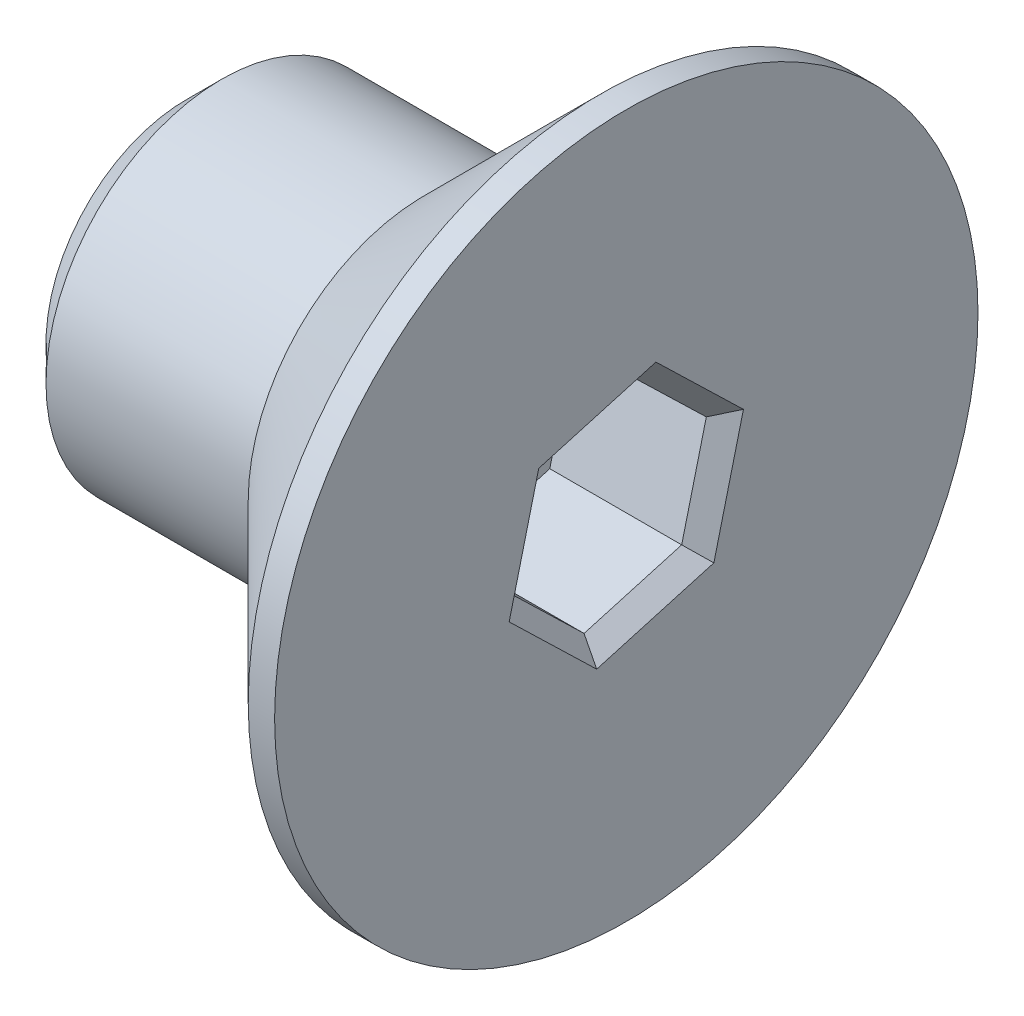
ISO-10303-21;
HEADER;
FILE_DESCRIPTION(('STEP AP214'),'2;1');
FILE_NAME('part.step','',(''),(''),'','','');
FILE_SCHEMA(('AUTOMOTIVE_DESIGN { 1 0 10303 214 1 1 1 1 }'));
ENDSEC;
DATA;
#1=APPLICATION_CONTEXT('core data for automotive mechanical design processes');
#2=APPLICATION_PROTOCOL_DEFINITION('international standard','automotive_design',2000,#1);
#3=PRODUCT_CONTEXT('',#1,'mechanical');
#4=PRODUCT('Part','Part','',(#3));
#5=PRODUCT_RELATED_PRODUCT_CATEGORY('part','',(#4));
#6=PRODUCT_DEFINITION_FORMATION('','',#4);
#7=PRODUCT_DEFINITION_CONTEXT('part definition',#1,'design');
#8=PRODUCT_DEFINITION('design','',#6,#7);
#9=PRODUCT_DEFINITION_SHAPE('','',#8);
#10=(LENGTH_UNIT() NAMED_UNIT(*) SI_UNIT(.MILLI.,.METRE.));
#11=(NAMED_UNIT(*) PLANE_ANGLE_UNIT() SI_UNIT($,.RADIAN.));
#12=(NAMED_UNIT(*) SI_UNIT($,.STERADIAN.) SOLID_ANGLE_UNIT());
#13=UNCERTAINTY_MEASURE_WITH_UNIT(LENGTH_MEASURE(1.E-05),#10,'distance_accuracy_value','');
#14=(GEOMETRIC_REPRESENTATION_CONTEXT(3) GLOBAL_UNCERTAINTY_ASSIGNED_CONTEXT((#13)) GLOBAL_UNIT_ASSIGNED_CONTEXT((#10,
#11,#12)) REPRESENTATION_CONTEXT('',''));
#15=CARTESIAN_POINT('',(0.,0.,0.));
#16=DIRECTION('',(0.,0.,1.));
#17=DIRECTION('',(1.,0.,0.));
#18=AXIS2_PLACEMENT_3D('',#15,#16,#17);
#19=CARTESIAN_POINT('',(4.68297067855263,13.4479055596939,0.388590849571879));
#20=DIRECTION('',(-1.,0.,0.));
#21=DIRECTION('',(0.,0.,1.));
#22=AXIS2_PLACEMENT_3D('',#19,#20,#21);
#23=PLANE('',#22);
#24=CARTESIAN_POINT('',(4.68297067851609,15.,0.));
#25=DIRECTION('',(1.,0.,0.));
#26=DIRECTION('',(0.,0.,-1.));
#27=AXIS2_PLACEMENT_3D('',#24,#25,#26);
#28=CIRCLE('',#27,1.6000000000905);
#29=CARTESIAN_POINT('',(4.68297067851609,15.,-1.6000000000905));
#30=VERTEX_POINT('',#29);
#31=EDGE_CURVE('E19',#30,#30,#28,.T.);
#32=ORIENTED_EDGE('',*,*,#31,.F.);
#33=EDGE_LOOP('',(#32));
#34=FACE_BOUND('',#33,.T.);
#35=ADVANCED_FACE('F16',(#34),#23,.T.);
#36=CARTESIAN_POINT('',(5.08297067847252,15.,0.));
#37=DIRECTION('',(1.,0.,0.));
#38=DIRECTION('',(0.,0.,-1.));
#39=AXIS2_PLACEMENT_3D('',#36,#37,#38);
#40=CONICAL_SURFACE('',#39,2.00000000002573,0.785398163370943);
#41=CARTESIAN_POINT('',(5.08297067855263,15.,0.));
#42=DIRECTION('',(-1.,0.,0.));
#43=DIRECTION('',(0.,0.,1.));
#44=AXIS2_PLACEMENT_3D('',#41,#42,#43);
#45=CIRCLE('',#44,2.);
#46=CARTESIAN_POINT('',(5.08297067855263,15.,2.));
#47=VERTEX_POINT('',#46);
#48=EDGE_CURVE('E117',#47,#47,#45,.F.);
#49=ORIENTED_EDGE('',*,*,#48,.F.);
#50=EDGE_LOOP('',(#49));
#51=FACE_BOUND('',#50,.T.);
#52=ORIENTED_EDGE('',*,*,#31,.T.);
#53=EDGE_LOOP('',(#52));
#54=FACE_BOUND('',#53,.T.);
#55=ADVANCED_FACE('F561',(#51,#54),#40,.T.);
#56=CARTESIAN_POINT('',(7.98297067854037,15.,0.));
#57=DIRECTION('',(1.,0.,0.));
#58=DIRECTION('',(0.,0.,-1.));
#59=AXIS2_PLACEMENT_3D('',#56,#57,#58);
#60=CONICAL_SURFACE('',#59,0.999999999990402,1.04719755118113);
#61=CARTESIAN_POINT('',(7.4056204093722,15.,0.));
#62=VERTEX_POINT('',#61);
#63=VERTEX_LOOP('',#62);
#64=FACE_BOUND('',#63,.T.);
#65=CARTESIAN_POINT('',(7.98297067854037,15.,0.));
#66=DIRECTION('',(1.,0.,0.));
#67=DIRECTION('',(0.,0.,-1.));
#68=AXIS2_PLACEMENT_3D('',#65,#66,#67);
#69=CIRCLE('',#68,0.999999999990402);
#70=CARTESIAN_POINT('',(7.9829706785465,14.0384696005274,-0.274698545464686));
#71=VERTEX_POINT('',#70);
#72=CARTESIAN_POINT('',(7.9829706785465,14.7571307190109,-0.970059025184754));
#73=VERTEX_POINT('',#72);
#74=EDGE_CURVE('E109',#71,#73,#69,.T.);
#75=ORIENTED_EDGE('',*,*,#74,.T.);
#76=CARTESIAN_POINT('',(7.98297067854037,15.,0.));
#77=DIRECTION('',(1.,0.,0.));
#78=DIRECTION('',(0.,0.,-1.));
#79=AXIS2_PLACEMENT_3D('',#76,#77,#78);
#80=CIRCLE('',#79,0.999999999990403);
#81=CARTESIAN_POINT('',(7.9829706785465,15.7186611184914,-0.695360479721949));
#82=VERTEX_POINT('',#81);
#83=EDGE_CURVE('E113',#73,#82,#80,.T.);
#84=ORIENTED_EDGE('',*,*,#83,.T.);
#85=CARTESIAN_POINT('',(7.98297067854037,15.,0.));
#86=DIRECTION('',(1.,0.,0.));
#87=DIRECTION('',(0.,0.,-1.));
#88=AXIS2_PLACEMENT_3D('',#85,#86,#87);
#89=CIRCLE('',#88,0.999999999990403);
#90=CARTESIAN_POINT('',(7.9829706785465,15.9615303994726,0.274698545464687));
#91=VERTEX_POINT('',#90);
#92=EDGE_CURVE('E134',#82,#91,#89,.T.);
#93=ORIENTED_EDGE('',*,*,#92,.T.);
#94=CARTESIAN_POINT('',(7.98297067854037,15.,0.));
#95=DIRECTION('',(1.,0.,0.));
#96=DIRECTION('',(0.,0.,-1.));
#97=AXIS2_PLACEMENT_3D('',#94,#95,#96);
#98=CIRCLE('',#97,0.999999999990402);
#99=CARTESIAN_POINT('',(7.9829706785465,15.2428692809813,0.970059025186637));
#100=VERTEX_POINT('',#99);
#101=EDGE_CURVE('E135',#91,#100,#98,.T.);
#102=ORIENTED_EDGE('',*,*,#101,.T.);
#103=CARTESIAN_POINT('',(7.98297067854037,15.,0.));
#104=DIRECTION('',(1.,0.,0.));
#105=DIRECTION('',(0.,0.,-1.));
#106=AXIS2_PLACEMENT_3D('',#103,#104,#105);
#107=CIRCLE('',#106,0.999999999990403);
#108=CARTESIAN_POINT('',(7.9829706785465,14.2813388815086,0.695360479721952));
#109=VERTEX_POINT('',#108);
#110=EDGE_CURVE('E206',#100,#109,#107,.T.);
#111=ORIENTED_EDGE('',*,*,#110,.T.);
#112=CARTESIAN_POINT('',(7.98297067854037,15.,0.));
#113=DIRECTION('',(1.,0.,0.));
#114=DIRECTION('',(0.,0.,-1.));
#115=AXIS2_PLACEMENT_3D('',#112,#113,#114);
#116=CIRCLE('',#115,0.999999999990402);
#117=EDGE_CURVE('E106',#109,#71,#116,.T.);
#118=ORIENTED_EDGE('',*,*,#117,.T.);
#119=EDGE_LOOP('',(#75,#84,#93,#102,#111,#118));
#120=FACE_BOUND('',#119,.T.);
#121=ADVANCED_FACE('F111',(#64,#120),#60,.F.);
#122=CARTESIAN_POINT('',(20.4084985096467,15.,0.));
#123=DIRECTION('',(-1.,0.,0.));
#124=DIRECTION('',(0.,0.,1.));
#125=AXIS2_PLACEMENT_3D('',#122,#123,#124);
#126=CYLINDRICAL_SURFACE('',#125,2.);
#127=CARTESIAN_POINT('',(7.38297067857729,15.,0.));
#128=DIRECTION('',(1.,0.,0.));
#129=DIRECTION('',(0.,-0.242869280970979,-0.970059025194158));
#130=AXIS2_PLACEMENT_3D('',#127,#128,#129);
#131=CIRCLE('',#130,2.00000000002573);
#132=CARTESIAN_POINT('',(7.38297067857729,14.5142614380518,-1.94011805041328));
#133=VERTEX_POINT('',#132);
#134=EDGE_CURVE('E126',#133,#133,#131,.T.);
#135=ORIENTED_EDGE('',*,*,#134,.F.);
#136=EDGE_LOOP('',(#135));
#137=FACE_BOUND('',#136,.T.);
#138=ORIENTED_EDGE('',*,*,#48,.T.);
#139=EDGE_LOOP('',(#138));
#140=FACE_BOUND('',#139,.T.);
#141=ADVANCED_FACE('F540',(#137,#140),#126,.T.);
#142=CARTESIAN_POINT('',(7.98297067855263,14.6828054416584,1.11027966994439));
#143=DIRECTION('',(-1.,0.,0.));
#144=DIRECTION('',(0.,0.,1.));
#145=AXIS2_PLACEMENT_3D('',#142,#143,#144);
#146=PLANE('',#145);
#147=ORIENTED_EDGE('',*,*,#74,.F.);
#148=DIRECTION('',(0.,0.274698545466005,-0.96153039947724));
#149=VECTOR('',#148,1.);
#150=CARTESIAN_POINT('',(7.98297067855263,13.879872321352,0.280441289506188));
#151=LINE('',#150,#149);
#152=CARTESIAN_POINT('',(7.98297067855263,14.1970668796936,-0.829838380438198));
#153=VERTEX_POINT('',#152);
#154=EDGE_CURVE('E121',#71,#153,#151,.T.);
#155=ORIENTED_EDGE('',*,*,#154,.T.);
#156=DIRECTION('',(0.,0.970059025191292,-0.242869280982425));
#157=VECTOR('',#156,1.);
#158=CARTESIAN_POINT('',(7.98297067855263,14.1970668796936,-0.829838380438198));
#159=LINE('',#158,#157);
#160=EDGE_CURVE('E119',#153,#73,#159,.T.);
#161=ORIENTED_EDGE('',*,*,#160,.T.);
#162=EDGE_LOOP('',(#147,#155,#161));
#163=FACE_BOUND('',#162,.T.);
#164=ADVANCED_FACE('F120',(#163),#146,.F.);
#165=CARTESIAN_POINT('',(7.98297067855263,14.6828054416584,1.11027966994439));
#166=DIRECTION('',(-1.,0.,0.));
#167=DIRECTION('',(0.,0.,1.));
#168=AXIS2_PLACEMENT_3D('',#165,#166,#167);
#169=PLANE('',#168);
#170=ORIENTED_EDGE('',*,*,#117,.F.);
#171=DIRECTION('',(0.,-0.695360479725287,-0.718661118494815));
#172=VECTOR('',#171,1.);
#173=CARTESIAN_POINT('',(7.98297067855263,14.6828054416584,1.11027966994439));
#174=LINE('',#173,#172);
#175=CARTESIAN_POINT('',(7.98297067855263,13.879872321352,0.280441289506188));
#176=VERTEX_POINT('',#175);
#177=EDGE_CURVE('E172',#109,#176,#174,.T.);
#178=ORIENTED_EDGE('',*,*,#177,.T.);
#179=DIRECTION('',(0.,0.274698545466005,-0.96153039947724));
#180=VECTOR('',#179,1.);
#181=CARTESIAN_POINT('',(7.98297067855263,13.879872321352,0.280441289506188));
#182=LINE('',#181,#180);
#183=EDGE_CURVE('E140',#176,#71,#182,.T.);
#184=ORIENTED_EDGE('',*,*,#183,.T.);
#185=EDGE_LOOP('',(#170,#178,#184));
#186=FACE_BOUND('',#185,.T.);
#187=ADVANCED_FACE('F218',(#186),#169,.F.);
#188=CARTESIAN_POINT('',(7.98297067855263,14.6828054416584,1.11027966994439));
#189=DIRECTION('',(-1.,0.,0.));
#190=DIRECTION('',(0.,0.,1.));
#191=AXIS2_PLACEMENT_3D('',#188,#189,#190);
#192=PLANE('',#191);
#193=ORIENTED_EDGE('',*,*,#110,.F.);
#194=DIRECTION('',(0.,-0.970059025191292,0.242869280982425));
#195=VECTOR('',#194,1.);
#196=CARTESIAN_POINT('',(7.98297067855263,15.8029331203064,0.829838380438198));
#197=LINE('',#196,#195);
#198=CARTESIAN_POINT('',(7.98297067855263,14.6828054416584,1.11027966994439));
#199=VERTEX_POINT('',#198);
#200=EDGE_CURVE('E158',#100,#199,#197,.T.);
#201=ORIENTED_EDGE('',*,*,#200,.T.);
#202=DIRECTION('',(0.,-0.695360479725287,-0.718661118494815));
#203=VECTOR('',#202,1.);
#204=CARTESIAN_POINT('',(7.98297067855263,14.6828054416584,1.11027966994439));
#205=LINE('',#204,#203);
#206=EDGE_CURVE('E169',#199,#109,#205,.T.);
#207=ORIENTED_EDGE('',*,*,#206,.T.);
#208=EDGE_LOOP('',(#193,#201,#207));
#209=FACE_BOUND('',#208,.T.);
#210=ADVANCED_FACE('F213',(#209),#192,.F.);
#211=CARTESIAN_POINT('',(7.98297067855263,14.6828054416584,1.11027966994439));
#212=DIRECTION('',(-1.,0.,0.));
#213=DIRECTION('',(0.,0.,1.));
#214=AXIS2_PLACEMENT_3D('',#211,#212,#213);
#215=PLANE('',#214);
#216=ORIENTED_EDGE('',*,*,#101,.F.);
#217=DIRECTION('',(0.,-0.274698545466005,0.96153039947724));
#218=VECTOR('',#217,1.);
#219=CARTESIAN_POINT('',(7.98297067855263,16.120127678648,-0.280441289506188));
#220=LINE('',#219,#218);
#221=CARTESIAN_POINT('',(7.98297067855263,15.8029331203064,0.829838380438197));
#222=VERTEX_POINT('',#221);
#223=EDGE_CURVE('E149',#91,#222,#220,.T.);
#224=ORIENTED_EDGE('',*,*,#223,.T.);
#225=DIRECTION('',(0.,-0.970059025191292,0.242869280982425));
#226=VECTOR('',#225,1.);
#227=CARTESIAN_POINT('',(7.98297067855263,15.8029331203064,0.829838380438198));
#228=LINE('',#227,#226);
#229=EDGE_CURVE('E155',#222,#100,#228,.T.);
#230=ORIENTED_EDGE('',*,*,#229,.T.);
#231=EDGE_LOOP('',(#216,#224,#230));
#232=FACE_BOUND('',#231,.T.);
#233=ADVANCED_FACE('F502',(#232),#215,.F.);
#234=CARTESIAN_POINT('',(7.98297067855263,14.6828054416584,1.11027966994439));
#235=DIRECTION('',(-1.,0.,0.));
#236=DIRECTION('',(0.,0.,1.));
#237=AXIS2_PLACEMENT_3D('',#234,#235,#236);
#238=PLANE('',#237);
#239=ORIENTED_EDGE('',*,*,#83,.F.);
#240=DIRECTION('',(0.,0.970059025191292,-0.242869280982425));
#241=VECTOR('',#240,1.);
#242=CARTESIAN_POINT('',(7.98297067855263,14.1970668796936,-0.829838380438198));
#243=LINE('',#242,#241);
#244=CARTESIAN_POINT('',(7.98297067855263,15.3171945583416,-1.11027966994439));
#245=VERTEX_POINT('',#244);
#246=EDGE_CURVE('E125',#73,#245,#243,.T.);
#247=ORIENTED_EDGE('',*,*,#246,.T.);
#248=DIRECTION('',(0.,0.695360479725287,0.718661118494815));
#249=VECTOR('',#248,1.);
#250=CARTESIAN_POINT('',(7.98297067855263,15.3171945583416,-1.11027966994439));
#251=LINE('',#250,#249);
#252=EDGE_CURVE('E132',#245,#82,#251,.T.);
#253=ORIENTED_EDGE('',*,*,#252,.T.);
#254=EDGE_LOOP('',(#239,#247,#253));
#255=FACE_BOUND('',#254,.T.);
#256=ADVANCED_FACE('F129',(#255),#238,.F.);
#257=CARTESIAN_POINT('',(7.98297067855263,14.6828054416584,1.11027966994439));
#258=DIRECTION('',(-1.,0.,0.));
#259=DIRECTION('',(0.,0.,1.));
#260=AXIS2_PLACEMENT_3D('',#257,#258,#259);
#261=PLANE('',#260);
#262=ORIENTED_EDGE('',*,*,#92,.F.);
#263=DIRECTION('',(0.,0.695360479725287,0.718661118494815));
#264=VECTOR('',#263,1.);
#265=CARTESIAN_POINT('',(7.98297067855263,15.3171945583416,-1.11027966994439));
#266=LINE('',#265,#264);
#267=CARTESIAN_POINT('',(7.98297067855263,16.120127678648,-0.28044128950619));
#268=VERTEX_POINT('',#267);
#269=EDGE_CURVE('E250',#82,#268,#266,.T.);
#270=ORIENTED_EDGE('',*,*,#269,.T.);
#271=DIRECTION('',(0.,-0.274698545466005,0.96153039947724));
#272=VECTOR('',#271,1.);
#273=CARTESIAN_POINT('',(7.98297067855263,16.120127678648,-0.280441289506188));
#274=LINE('',#273,#272);
#275=EDGE_CURVE('E152',#268,#91,#274,.T.);
#276=ORIENTED_EDGE('',*,*,#275,.T.);
#277=EDGE_LOOP('',(#262,#270,#276));
#278=FACE_BOUND('',#277,.T.);
#279=ADVANCED_FACE('F481',(#278),#261,.F.);
#280=CARTESIAN_POINT('',(9.38297067858684,15.,0.));
#281=DIRECTION('',(1.,0.,0.));
#282=DIRECTION('',(0.,0.,-1.));
#283=AXIS2_PLACEMENT_3D('',#280,#281,#282);
#284=CONICAL_SURFACE('',#283,4.0000000000585,0.785398163403254);
#285=CARTESIAN_POINT('',(9.38297067855262,15.,0.));
#286=DIRECTION('',(-1.,0.,0.));
#287=DIRECTION('',(0.,0.,1.));
#288=AXIS2_PLACEMENT_3D('',#285,#286,#287);
#289=CIRCLE('',#288,4.);
#290=CARTESIAN_POINT('',(9.38297067855262,15.,4.));
#291=VERTEX_POINT('',#290);
#292=EDGE_CURVE('E246',#291,#291,#289,.F.);
#293=ORIENTED_EDGE('',*,*,#292,.F.);
#294=EDGE_LOOP('',(#293));
#295=FACE_BOUND('',#294,.T.);
#296=ORIENTED_EDGE('',*,*,#134,.T.);
#297=EDGE_LOOP('',(#296));
#298=FACE_BOUND('',#297,.T.);
#299=ADVANCED_FACE('F471',(#295,#298),#284,.T.);
#300=CARTESIAN_POINT('',(7.98297067855263,14.1970668796936,-0.829838380438198));
#301=DIRECTION('',(0.,-0.242869280982425,-0.970059025191292));
#302=DIRECTION('',(0.,0.970059025191292,-0.242869280982425));
#303=AXIS2_PLACEMENT_3D('',#300,#301,#302);
#304=PLANE('',#303);
#305=DIRECTION('',(0.,-0.970059025191292,0.242869280982425));
#306=VECTOR('',#305,1.);
#307=CARTESIAN_POINT('',(9.48297067855263,15.3171945583416,-1.11027966994439));
#308=LINE('',#307,#306);
#309=CARTESIAN_POINT('',(9.48297067855263,15.3171945583416,-1.11027966994439));
#310=VERTEX_POINT('',#309);
#311=CARTESIAN_POINT('',(9.48297067855263,14.1970668796936,-0.829838380438198));
#312=VERTEX_POINT('',#311);
#313=EDGE_CURVE('E240',#310,#312,#308,.T.);
#314=ORIENTED_EDGE('',*,*,#313,.F.);
#315=DIRECTION('',(1.,0.,0.));
#316=VECTOR('',#315,1.);
#317=CARTESIAN_POINT('',(7.98297067855263,15.3171945583416,-1.11027966994439));
#318=LINE('',#317,#316);
#319=EDGE_CURVE('E139',#310,#245,#318,.F.);
#320=ORIENTED_EDGE('',*,*,#319,.T.);
#321=ORIENTED_EDGE('',*,*,#246,.F.);
#322=ORIENTED_EDGE('',*,*,#160,.F.);
#323=DIRECTION('',(1.,0.,0.));
#324=VECTOR('',#323,1.);
#325=CARTESIAN_POINT('',(7.98297067855263,14.1970668796936,-0.829838380438198));
#326=LINE('',#325,#324);
#327=EDGE_CURVE('E173',#153,#312,#326,.T.);
#328=ORIENTED_EDGE('',*,*,#327,.T.);
#329=EDGE_LOOP('',(#314,#320,#321,#322,#328));
#330=FACE_BOUND('',#329,.T.);
#331=ADVANCED_FACE('F137',(#330),#304,.F.);
#332=CARTESIAN_POINT('',(7.98297067855263,13.879872321352,0.280441289506188));
#333=DIRECTION('',(0.,-0.96153039947724,-0.274698545466005));
#334=DIRECTION('',(0.,0.274698545466005,-0.96153039947724));
#335=AXIS2_PLACEMENT_3D('',#332,#333,#334);
#336=PLANE('',#335);
#337=DIRECTION('',(0.,-0.274698545466006,0.96153039947724));
#338=VECTOR('',#337,1.);
#339=CARTESIAN_POINT('',(9.48297067855263,14.1970668796936,-0.829838380438198));
#340=LINE('',#339,#338);
#341=CARTESIAN_POINT('',(9.48297067855263,13.879872321352,0.280441289506188));
#342=VERTEX_POINT('',#341);
#343=EDGE_CURVE('E230',#312,#342,#340,.T.);
#344=ORIENTED_EDGE('',*,*,#343,.F.);
#345=ORIENTED_EDGE('',*,*,#327,.F.);
#346=ORIENTED_EDGE('',*,*,#154,.F.);
#347=ORIENTED_EDGE('',*,*,#183,.F.);
#348=DIRECTION('',(1.,0.,0.));
#349=VECTOR('',#348,1.);
#350=CARTESIAN_POINT('',(7.98297067855263,13.879872321352,0.280441289506188));
#351=LINE('',#350,#349);
#352=EDGE_CURVE('E159',#176,#342,#351,.T.);
#353=ORIENTED_EDGE('',*,*,#352,.T.);
#354=EDGE_LOOP('',(#344,#345,#346,#347,#353));
#355=FACE_BOUND('',#354,.T.);
#356=ADVANCED_FACE('F229',(#355),#336,.F.);
#357=CARTESIAN_POINT('',(7.98297067855263,14.6828054416584,1.11027966994439));
#358=DIRECTION('',(0.,-0.718661118494815,0.695360479725287));
#359=DIRECTION('',(0.,-0.695360479725287,-0.718661118494815));
#360=AXIS2_PLACEMENT_3D('',#357,#358,#359);
#361=PLANE('',#360);
#362=DIRECTION('',(0.,0.695360479725286,0.718661118494816));
#363=VECTOR('',#362,1.);
#364=CARTESIAN_POINT('',(9.48297067855263,13.879872321352,0.280441289506188));
#365=LINE('',#364,#363);
#366=CARTESIAN_POINT('',(9.48297067855263,14.6828054416584,1.11027966994439));
#367=VERTEX_POINT('',#366);
#368=EDGE_CURVE('E224',#342,#367,#365,.T.);
#369=ORIENTED_EDGE('',*,*,#368,.F.);
#370=ORIENTED_EDGE('',*,*,#352,.F.);
#371=ORIENTED_EDGE('',*,*,#177,.F.);
#372=ORIENTED_EDGE('',*,*,#206,.F.);
#373=DIRECTION('',(1.,0.,0.));
#374=VECTOR('',#373,1.);
#375=CARTESIAN_POINT('',(7.98297067855263,14.6828054416584,1.11027966994439));
#376=LINE('',#375,#374);
#377=EDGE_CURVE('E166',#199,#367,#376,.T.);
#378=ORIENTED_EDGE('',*,*,#377,.T.);
#379=EDGE_LOOP('',(#369,#370,#371,#372,#378));
#380=FACE_BOUND('',#379,.T.);
#381=ADVANCED_FACE('F222',(#380),#361,.F.);
#382=CARTESIAN_POINT('',(7.98297067855263,15.8029331203064,0.829838380438198));
#383=DIRECTION('',(0.,0.242869280982425,0.970059025191292));
#384=DIRECTION('',(0.,-0.970059025191292,0.242869280982425));
#385=AXIS2_PLACEMENT_3D('',#382,#383,#384);
#386=PLANE('',#385);
#387=DIRECTION('',(0.,0.970059025191292,-0.242869280982426));
#388=VECTOR('',#387,1.);
#389=CARTESIAN_POINT('',(9.48297067855263,14.6828054416584,1.11027966994439));
#390=LINE('',#389,#388);
#391=CARTESIAN_POINT('',(9.48297067855263,15.8029331203064,0.829838380438198));
#392=VERTEX_POINT('',#391);
#393=EDGE_CURVE('E291',#367,#392,#390,.T.);
#394=ORIENTED_EDGE('',*,*,#393,.F.);
#395=ORIENTED_EDGE('',*,*,#377,.F.);
#396=ORIENTED_EDGE('',*,*,#200,.F.);
#397=ORIENTED_EDGE('',*,*,#229,.F.);
#398=DIRECTION('',(1.,0.,0.));
#399=VECTOR('',#398,1.);
#400=CARTESIAN_POINT('',(7.98297067855263,15.8029331203064,0.829838380438197));
#401=LINE('',#400,#399);
#402=EDGE_CURVE('E151',#222,#392,#401,.T.);
#403=ORIENTED_EDGE('',*,*,#402,.T.);
#404=EDGE_LOOP('',(#394,#395,#396,#397,#403));
#405=FACE_BOUND('',#404,.T.);
#406=ADVANCED_FACE('F301',(#405),#386,.F.);
#407=CARTESIAN_POINT('',(7.98297067855263,16.120127678648,-0.280441289506188));
#408=DIRECTION('',(0.,0.96153039947724,0.274698545466005));
#409=DIRECTION('',(0.,-0.274698545466005,0.96153039947724));
#410=AXIS2_PLACEMENT_3D('',#407,#408,#409);
#411=PLANE('',#410);
#412=DIRECTION('',(0.,0.274698545466004,-0.961530399477241));
#413=VECTOR('',#412,1.);
#414=CARTESIAN_POINT('',(9.48297067855263,15.8029331203064,0.829838380438198));
#415=LINE('',#414,#413);
#416=CARTESIAN_POINT('',(9.48297067855263,16.120127678648,-0.280441289506188));
#417=VERTEX_POINT('',#416);
#418=EDGE_CURVE('E269',#392,#417,#415,.T.);
#419=ORIENTED_EDGE('',*,*,#418,.F.);
#420=ORIENTED_EDGE('',*,*,#402,.F.);
#421=ORIENTED_EDGE('',*,*,#223,.F.);
#422=ORIENTED_EDGE('',*,*,#275,.F.);
#423=DIRECTION('',(1.,0.,0.));
#424=VECTOR('',#423,1.);
#425=CARTESIAN_POINT('',(7.98297067855263,16.120127678648,-0.28044128950619));
#426=LINE('',#425,#424);
#427=EDGE_CURVE('E254',#268,#417,#426,.T.);
#428=ORIENTED_EDGE('',*,*,#427,.T.);
#429=EDGE_LOOP('',(#419,#420,#421,#422,#428));
#430=FACE_BOUND('',#429,.T.);
#431=ADVANCED_FACE('F267',(#430),#411,.F.);
#432=CARTESIAN_POINT('',(7.98297067855263,15.3171945583416,-1.11027966994439));
#433=DIRECTION('',(0.,0.718661118494815,-0.695360479725287));
#434=DIRECTION('',(0.,0.695360479725287,0.718661118494815));
#435=AXIS2_PLACEMENT_3D('',#432,#433,#434);
#436=PLANE('',#435);
#437=DIRECTION('',(0.,-0.695360479725286,-0.718661118494816));
#438=VECTOR('',#437,1.);
#439=CARTESIAN_POINT('',(9.48297067855263,16.120127678648,-0.280441289506189));
#440=LINE('',#439,#438);
#441=EDGE_CURVE('E279',#417,#310,#440,.T.);
#442=ORIENTED_EDGE('',*,*,#441,.F.);
#443=ORIENTED_EDGE('',*,*,#427,.F.);
#444=ORIENTED_EDGE('',*,*,#269,.F.);
#445=ORIENTED_EDGE('',*,*,#252,.F.);
#446=ORIENTED_EDGE('',*,*,#319,.F.);
#447=EDGE_LOOP('',(#442,#443,#444,#445,#446));
#448=FACE_BOUND('',#447,.T.);
#449=ADVANCED_FACE('F280',(#448),#436,.F.);
#450=CARTESIAN_POINT('',(20.4084985096467,15.,0.));
#451=DIRECTION('',(-1.,0.,0.));
#452=DIRECTION('',(0.,0.,1.));
#453=AXIS2_PLACEMENT_3D('',#450,#451,#452);
#454=CYLINDRICAL_SURFACE('',#453,4.);
#455=CARTESIAN_POINT('',(9.68297067855263,15.,0.));
#456=DIRECTION('',(-1.,0.,0.));
#457=DIRECTION('',(0.,0.,1.));
#458=AXIS2_PLACEMENT_3D('',#455,#456,#457);
#459=CIRCLE('',#458,4.);
#460=CARTESIAN_POINT('',(9.68297067855263,15.,4.));
#461=VERTEX_POINT('',#460);
#462=EDGE_CURVE('E199',#461,#461,#459,.F.);
#463=ORIENTED_EDGE('',*,*,#462,.F.);
#464=EDGE_LOOP('',(#463));
#465=FACE_BOUND('',#464,.T.);
#466=ORIENTED_EDGE('',*,*,#292,.T.);
#467=EDGE_LOOP('',(#466));
#468=FACE_BOUND('',#467,.T.);
#469=ADVANCED_FACE('F323',(#465,#468),#454,.T.);
#470=CARTESIAN_POINT('',(9.48297067855263,14.1970668796936,-0.829838380438198));
#471=DIRECTION('',(0.707106781186552,0.171734515524573,0.685935314863971));
#472=DIRECTION('',(0.696279757432863,0.,-0.717770506073657));
#473=AXIS2_PLACEMENT_3D('',#470,#471,#472);
#474=PLANE('',#473);
#475=DIRECTION('',(-0.654653670707977,0.525643114541624,0.543256741848229));
#476=VECTOR('',#475,1.);
#477=CARTESIAN_POINT('',(9.68297067855263,14.0364802556323,-0.995806056525838));
#478=LINE('',#477,#476);
#479=CARTESIAN_POINT('',(9.68297067855263,14.0364802556323,-0.995806056525839));
#480=VERTEX_POINT('',#479);
#481=EDGE_CURVE('E237',#480,#312,#478,.T.);
#482=ORIENTED_EDGE('',*,*,#481,.F.);
#483=DIRECTION('',(0.,-0.970059025191292,0.242869280982425));
#484=VECTOR('',#483,1.);
#485=CARTESIAN_POINT('',(9.68297067855263,15.3806334700099,-1.33233560393326));
#486=LINE('',#485,#484);
#487=CARTESIAN_POINT('',(9.68297067855263,15.3806334700099,-1.33233560393326));
#488=VERTEX_POINT('',#487);
#489=EDGE_CURVE('E202',#488,#480,#486,.T.);
#490=ORIENTED_EDGE('',*,*,#489,.F.);
#491=DIRECTION('',(0.654653670707972,0.207652581946923,-0.726848661441537));
#492=VECTOR('',#491,1.);
#493=CARTESIAN_POINT('',(9.48297067855263,15.3171945583416,-1.11027966994439));
#494=LINE('',#493,#492);
#495=EDGE_CURVE('E203',#310,#488,#494,.T.);
#496=ORIENTED_EDGE('',*,*,#495,.F.);
#497=ORIENTED_EDGE('',*,*,#313,.T.);
#498=EDGE_LOOP('',(#482,#490,#496,#497));
#499=FACE_BOUND('',#498,.T.);
#500=ADVANCED_FACE('F321',(#499),#474,.T.);
#501=CARTESIAN_POINT('',(9.48297067855263,13.879872321352,0.280441289506189));
#502=DIRECTION('',(0.707106781186552,0.679904665787362,0.194241204281092));
#503=DIRECTION('',(-0.693105696628153,0.720835968373945,0.));
#504=AXIS2_PLACEMENT_3D('',#501,#502,#503);
#505=PLANE('',#504);
#506=ORIENTED_EDGE('',*,*,#481,.T.);
#507=ORIENTED_EDGE('',*,*,#343,.T.);
#508=DIRECTION('',(-0.654653670707969,0.73329569648855,-0.183591919593306));
#509=VECTOR('',#508,1.);
#510=CARTESIAN_POINT('',(9.68297067855263,13.6558467856223,0.336529547407426));
#511=LINE('',#510,#509);
#512=CARTESIAN_POINT('',(9.68297067855263,13.6558467856223,0.336529547407427));
#513=VERTEX_POINT('',#512);
#514=EDGE_CURVE('E235',#513,#342,#511,.T.);
#515=ORIENTED_EDGE('',*,*,#514,.F.);
#516=DIRECTION('',(0.,-0.274698545466006,0.96153039947724));
#517=VECTOR('',#516,1.);
#518=CARTESIAN_POINT('',(9.68297067855263,14.0364802556323,-0.995806056525838));
#519=LINE('',#518,#517);
#520=EDGE_CURVE('E315',#480,#513,#519,.T.);
#521=ORIENTED_EDGE('',*,*,#520,.F.);
#522=EDGE_LOOP('',(#506,#507,#515,#521));
#523=FACE_BOUND('',#522,.T.);
#524=ADVANCED_FACE('F233',(#523),#505,.T.);
#525=CARTESIAN_POINT('',(9.48297067855263,14.6828054416584,1.11027966994439));
#526=DIRECTION('',(0.707106781186553,0.508170150262789,-0.491694110582877));
#527=DIRECTION('',(-0.583588456411559,0.812049575791512,0.));
#528=AXIS2_PLACEMENT_3D('',#525,#526,#527);
#529=PLANE('',#528);
#530=ORIENTED_EDGE('',*,*,#514,.T.);
#531=ORIENTED_EDGE('',*,*,#368,.T.);
#532=DIRECTION('',(-0.654653670707972,0.207652581946923,-0.726848661441538));
#533=VECTOR('',#532,1.);
#534=CARTESIAN_POINT('',(9.68297067855263,14.6193665299901,1.33233560393327));
#535=LINE('',#534,#533);
#536=CARTESIAN_POINT('',(9.68297067855263,14.6193665299901,1.33233560393327));
#537=VERTEX_POINT('',#536);
#538=EDGE_CURVE('E294',#537,#367,#535,.T.);
#539=ORIENTED_EDGE('',*,*,#538,.F.);
#540=DIRECTION('',(0.,0.695360479725287,0.718661118494815));
#541=VECTOR('',#540,1.);
#542=CARTESIAN_POINT('',(9.68297067855263,13.6558467856223,0.336529547407427));
#543=LINE('',#542,#541);
#544=EDGE_CURVE('E309',#513,#537,#543,.T.);
#545=ORIENTED_EDGE('',*,*,#544,.F.);
#546=EDGE_LOOP('',(#530,#531,#539,#545));
#547=FACE_BOUND('',#546,.T.);
#548=ADVANCED_FACE('F298',(#547),#529,.T.);
#549=CARTESIAN_POINT('',(9.48297067855263,15.8029331203064,0.829838380438198));
#550=DIRECTION('',(0.707106781186552,-0.171734515524573,-0.68593531486397));
#551=DIRECTION('',(-0.696279757432863,0.,-0.717770506073657));
#552=AXIS2_PLACEMENT_3D('',#549,#550,#551);
#553=PLANE('',#552);
#554=ORIENTED_EDGE('',*,*,#538,.T.);
#555=ORIENTED_EDGE('',*,*,#393,.T.);
#556=DIRECTION('',(-0.654653670707972,-0.525643114541624,-0.543256741848234));
#557=VECTOR('',#556,1.);
#558=CARTESIAN_POINT('',(9.68297067855263,15.9635197443677,0.995806056525839));
#559=LINE('',#558,#557);
#560=CARTESIAN_POINT('',(9.68297067855263,15.9635197443677,0.995806056525839));
#561=VERTEX_POINT('',#560);
#562=EDGE_CURVE('E276',#561,#392,#559,.T.);
#563=ORIENTED_EDGE('',*,*,#562,.F.);
#564=DIRECTION('',(0.,0.970059025191292,-0.242869280982425));
#565=VECTOR('',#564,1.);
#566=CARTESIAN_POINT('',(9.68297067855263,14.6193665299901,1.33233560393327));
#567=LINE('',#566,#565);
#568=EDGE_CURVE('E306',#537,#561,#567,.T.);
#569=ORIENTED_EDGE('',*,*,#568,.F.);
#570=EDGE_LOOP('',(#554,#555,#563,#569));
#571=FACE_BOUND('',#570,.T.);
#572=ADVANCED_FACE('F304',(#571),#553,.T.);
#573=CARTESIAN_POINT('',(9.48297067855263,16.120127678648,-0.280441289506188));
#574=DIRECTION('',(0.707106781186552,-0.679904665787363,-0.194241204281092));
#575=DIRECTION('',(0.693105696628154,0.720835968373944,0.));
#576=AXIS2_PLACEMENT_3D('',#573,#574,#575);
#577=PLANE('',#576);
#578=ORIENTED_EDGE('',*,*,#562,.T.);
#579=ORIENTED_EDGE('',*,*,#418,.T.);
#580=DIRECTION('',(-0.654653670707975,-0.733295696488545,0.183591919593305));
#581=VECTOR('',#580,1.);
#582=CARTESIAN_POINT('',(9.68297067855263,16.3441532143776,-0.336529547407427));
#583=LINE('',#582,#581);
#584=CARTESIAN_POINT('',(9.68297067855263,16.3441532143776,-0.336529547407426));
#585=VERTEX_POINT('',#584);
#586=EDGE_CURVE('E34',#585,#417,#583,.T.);
#587=ORIENTED_EDGE('',*,*,#586,.F.);
#588=DIRECTION('',(0.,0.274698545466004,-0.961530399477241));
#589=VECTOR('',#588,1.);
#590=CARTESIAN_POINT('',(9.68297067855263,15.9635197443677,0.995806056525839));
#591=LINE('',#590,#589);
#592=EDGE_CURVE('E25',#561,#585,#591,.T.);
#593=ORIENTED_EDGE('',*,*,#592,.F.);
#594=EDGE_LOOP('',(#578,#579,#587,#593));
#595=FACE_BOUND('',#594,.T.);
#596=ADVANCED_FACE('F275',(#595),#577,.T.);
#597=CARTESIAN_POINT('',(9.48297067855263,15.3171945583416,-1.11027966994439));
#598=DIRECTION('',(0.707106781186552,-0.508170150262789,0.491694110582878));
#599=DIRECTION('',(0.58358845641156,0.812049575791511,0.));
#600=AXIS2_PLACEMENT_3D('',#597,#598,#599);
#601=PLANE('',#600);
#602=ORIENTED_EDGE('',*,*,#495,.T.);
#603=DIRECTION('',(0.,-0.695360479725286,-0.718661118494816));
#604=VECTOR('',#603,1.);
#605=CARTESIAN_POINT('',(9.68297067855263,16.3441532143776,-0.336529547407426));
#606=LINE('',#605,#604);
#607=EDGE_CURVE('E10',#585,#488,#606,.T.);
#608=ORIENTED_EDGE('',*,*,#607,.F.);
#609=ORIENTED_EDGE('',*,*,#586,.T.);
#610=ORIENTED_EDGE('',*,*,#441,.T.);
#611=EDGE_LOOP('',(#602,#608,#609,#610));
#612=FACE_BOUND('',#611,.T.);
#613=ADVANCED_FACE('F285',(#612),#601,.T.);
#614=CARTESIAN_POINT('',(9.68297067855263,15.,0.));
#615=DIRECTION('',(1.,0.,0.));
#616=DIRECTION('',(0.,1.,0.));
#617=AXIS2_PLACEMENT_3D('',#614,#615,#616);
#618=PLANE('',#617);
#619=ORIENTED_EDGE('',*,*,#592,.T.);
#620=ORIENTED_EDGE('',*,*,#607,.T.);
#621=ORIENTED_EDGE('',*,*,#489,.T.);
#622=ORIENTED_EDGE('',*,*,#520,.T.);
#623=ORIENTED_EDGE('',*,*,#544,.T.);
#624=ORIENTED_EDGE('',*,*,#568,.T.);
#625=EDGE_LOOP('',(#619,#620,#621,#622,#623,#624));
#626=FACE_BOUND('',#625,.T.);
#627=ORIENTED_EDGE('',*,*,#462,.T.);
#628=EDGE_LOOP('',(#627));
#629=FACE_BOUND('',#628,.T.);
#630=ADVANCED_FACE('F312',(#626,#629),#618,.T.);
#631=CLOSED_SHELL('',(#35,#55,#121,#141,#164,#187,#210,#233,#256,#279,#299,#331,#356,#381,#406,
#431,#449,#469,#500,#524,#548,#572,#596,#613,#630));
#632=MANIFOLD_SOLID_BREP('B1',#631);
#633=ADVANCED_BREP_SHAPE_REPRESENTATION('',(#18,#632),#14);
#634=SHAPE_DEFINITION_REPRESENTATION(#9,#633);
ENDSEC;
END-ISO-10303-21;
